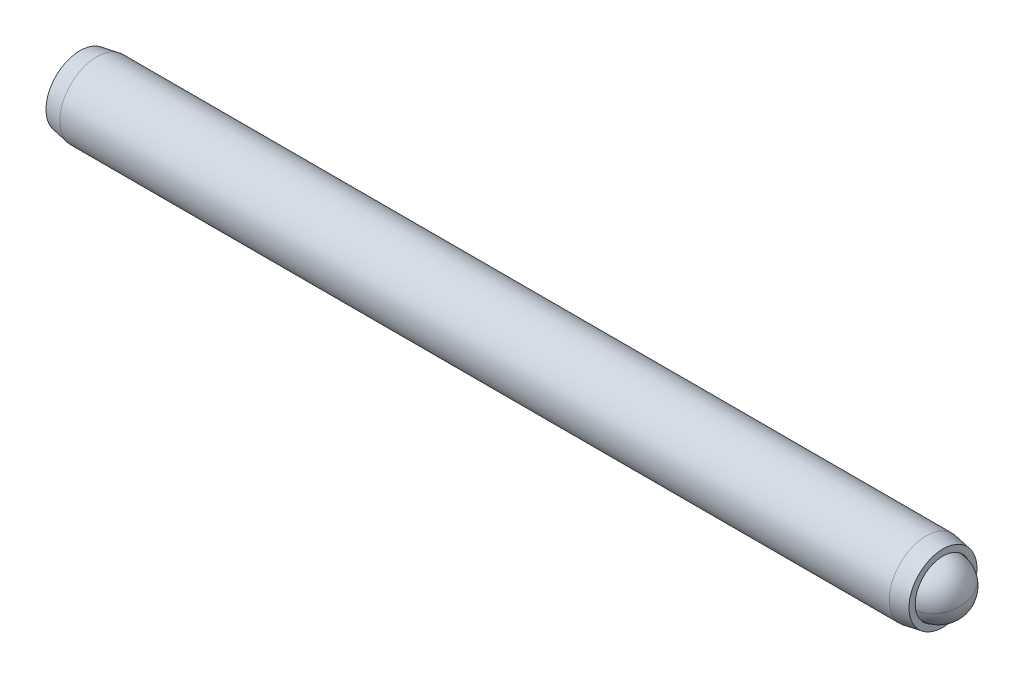
ISO-10303-21;
HEADER;
FILE_DESCRIPTION(('STEP AP214'),'2;1');
FILE_NAME('part.step','',(''),(''),'','','');
FILE_SCHEMA(('AUTOMOTIVE_DESIGN { 1 0 10303 214 1 1 1 1 }'));
ENDSEC;
DATA;
#1=APPLICATION_CONTEXT('core data for automotive mechanical design processes');
#2=APPLICATION_PROTOCOL_DEFINITION('international standard','automotive_design',2000,#1);
#3=PRODUCT_CONTEXT('',#1,'mechanical');
#4=PRODUCT('Part','Part','',(#3));
#5=PRODUCT_RELATED_PRODUCT_CATEGORY('part','',(#4));
#6=PRODUCT_DEFINITION_FORMATION('','',#4);
#7=PRODUCT_DEFINITION_CONTEXT('part definition',#1,'design');
#8=PRODUCT_DEFINITION('design','',#6,#7);
#9=PRODUCT_DEFINITION_SHAPE('','',#8);
#10=(LENGTH_UNIT() NAMED_UNIT(*) SI_UNIT(.MILLI.,.METRE.));
#11=(NAMED_UNIT(*) PLANE_ANGLE_UNIT() SI_UNIT($,.RADIAN.));
#12=(NAMED_UNIT(*) SI_UNIT($,.STERADIAN.) SOLID_ANGLE_UNIT());
#13=UNCERTAINTY_MEASURE_WITH_UNIT(LENGTH_MEASURE(1.E-05),#10,'distance_accuracy_value','');
#14=(GEOMETRIC_REPRESENTATION_CONTEXT(3) GLOBAL_UNCERTAINTY_ASSIGNED_CONTEXT((#13)) GLOBAL_UNIT_ASSIGNED_CONTEXT((#10,
#11,#12)) REPRESENTATION_CONTEXT('',''));
#15=CARTESIAN_POINT('',(0.,0.,0.));
#16=DIRECTION('',(0.,0.,1.));
#17=DIRECTION('',(1.,0.,0.));
#18=AXIS2_PLACEMENT_3D('',#15,#16,#17);
#19=CARTESIAN_POINT('',(-39.8013459470191,2.74204998828508,-0.965131231055238));
#20=DIRECTION('',(-1.,0.,0.));
#21=DIRECTION('',(0.,-1.,0.));
#22=AXIS2_PLACEMENT_3D('',#19,#20,#21);
#23=PLANE('',#22);
#24=DIRECTION('',(0.,0.866025403784439,-0.5));
#25=VECTOR('',#24,1.);
#26=CARTESIAN_POINT('',(-39.8013459470191,2.61504998828507,-2.33078112403966));
#27=LINE('',#26,#25);
#28=CARTESIAN_POINT('',(-39.8013459470191,1.49586248828507,-1.68461791964099));
#29=VERTEX_POINT('',#28);
#30=CARTESIAN_POINT('',(-39.8013459470191,2.74204998828508,-2.40410460822675));
#31=VERTEX_POINT('',#30);
#32=EDGE_CURVE('P0_E164',#29,#31,#27,.T.);
#33=ORIENTED_EDGE('',*,*,#32,.T.);
#34=DIRECTION('',(0.,0.866025403784439,0.5));
#35=VECTOR('',#34,1.);
#36=CARTESIAN_POINT('',(-39.8013459470191,3.86123748828508,-1.75794140382808));
#37=LINE('',#36,#35);
#38=CARTESIAN_POINT('',(-39.8013459470191,3.98823748828509,-1.68461791964099));
#39=VERTEX_POINT('',#38);
#40=EDGE_CURVE('P0_E166',#31,#39,#37,.T.);
#41=ORIENTED_EDGE('',*,*,#40,.T.);
#42=DIRECTION('',(0.,0.,1.));
#43=VECTOR('',#42,1.);
#44=CARTESIAN_POINT('',(-39.8013459470191,3.98823748828509,-0.392291510843657));
#45=LINE('',#44,#43);
#46=CARTESIAN_POINT('',(-39.8013459470191,3.98823748828509,-0.245644542469486));
#47=VERTEX_POINT('',#46);
#48=EDGE_CURVE('P0_E156',#39,#47,#45,.T.);
#49=ORIENTED_EDGE('',*,*,#48,.T.);
#50=DIRECTION('',(0.,-0.866025403784438,0.5));
#51=VECTOR('',#50,1.);
#52=CARTESIAN_POINT('',(-39.8013459470191,2.86904998828509,0.400518661929182));
#53=LINE('',#52,#51);
#54=CARTESIAN_POINT('',(-39.8013459470191,2.74204998828508,0.473842146116268));
#55=VERTEX_POINT('',#54);
#56=EDGE_CURVE('P0_E158',#47,#55,#53,.T.);
#57=ORIENTED_EDGE('',*,*,#56,.T.);
#58=DIRECTION('',(0.,-0.866025403784439,-0.499999999999999));
#59=VECTOR('',#58,1.);
#60=CARTESIAN_POINT('',(-39.8013459470191,1.62286248828507,-0.172321058282399));
#61=LINE('',#60,#59);
#62=CARTESIAN_POINT('',(-39.8013459470191,1.49586248828507,-0.245644542469485));
#63=VERTEX_POINT('',#62);
#64=EDGE_CURVE('P0_E160',#55,#63,#61,.T.);
#65=ORIENTED_EDGE('',*,*,#64,.T.);
#66=DIRECTION('',(0.,0.,-1.));
#67=VECTOR('',#66,1.);
#68=CARTESIAN_POINT('',(-39.8013459470191,1.49586248828507,-1.53797095126682));
#69=LINE('',#68,#67);
#70=EDGE_CURVE('P0_E162',#63,#29,#69,.T.);
#71=ORIENTED_EDGE('',*,*,#70,.T.);
#72=EDGE_LOOP('',(#33,#41,#49,#57,#65,#71));
#73=FACE_BOUND('',#72,.T.);
#74=CARTESIAN_POINT('',(-39.8013459470191,2.74204998828508,-0.965131231055238));
#75=DIRECTION('',(1.,0.,0.));
#76=DIRECTION('',(0.,1.,0.));
#77=AXIS2_PLACEMENT_3D('',#74,#75,#76);
#78=CIRCLE('',#77,2.921);
#79=CARTESIAN_POINT('',(-39.8013459470191,5.66304998828509,-0.965131231055238));
#80=VERTEX_POINT('',#79);
#81=EDGE_CURVE('P0_E150',#80,#80,#78,.T.);
#82=ORIENTED_EDGE('',*,*,#81,.F.);
#83=EDGE_LOOP('',(#82));
#84=FACE_BOUND('',#83,.T.);
#85=ADVANCED_FACE('P0_F17',(#73,#84),#23,.T.);
#86=CARTESIAN_POINT('',(-38.3608403648362,2.74204998828508,-0.965131231055238));
#87=DIRECTION('',(1.,0.,0.));
#88=DIRECTION('',(0.,1.,0.));
#89=AXIS2_PLACEMENT_3D('',#86,#87,#88);
#90=CONICAL_SURFACE('',#89,3.175,0.174532925199435);
#91=ORIENTED_EDGE('',*,*,#81,.T.);
#92=EDGE_LOOP('',(#91));
#93=FACE_BOUND('',#92,.T.);
#94=CARTESIAN_POINT('',(-38.3608403648362,2.74204998828508,-0.965131231055238));
#95=DIRECTION('',(1.,0.,0.));
#96=DIRECTION('',(0.,1.,0.));
#97=AXIS2_PLACEMENT_3D('',#94,#95,#96);
#98=CIRCLE('',#97,3.175);
#99=CARTESIAN_POINT('',(-38.3608403648362,5.91704998828509,-0.965131231055238));
#100=VERTEX_POINT('',#99);
#101=EDGE_CURVE('P0_E147',#100,#100,#98,.T.);
#102=ORIENTED_EDGE('',*,*,#101,.F.);
#103=EDGE_LOOP('',(#102));
#104=FACE_BOUND('',#103,.T.);
#105=ADVANCED_FACE('P0_F225',(#93,#104),#90,.T.);
#106=CARTESIAN_POINT('',(30.64980800758,2.7420499882851,-0.965131231055238));
#107=DIRECTION('',(1.,0.,0.));
#108=DIRECTION('',(0.,1.,0.));
#109=AXIS2_PLACEMENT_3D('',#106,#107,#108);
#110=CYLINDRICAL_SURFACE('',#109,3.175);
#111=ORIENTED_EDGE('',*,*,#101,.T.);
#112=EDGE_LOOP('',(#111));
#113=FACE_BOUND('',#112,.T.);
#114=CARTESIAN_POINT('',(32.926148470798,2.7420499882851,-0.965131231055238));
#115=DIRECTION('',(1.,0.,0.));
#116=DIRECTION('',(0.,1.,0.));
#117=AXIS2_PLACEMENT_3D('',#114,#115,#116);
#118=CIRCLE('',#117,3.17499999999999);
#119=CARTESIAN_POINT('',(32.926148470798,5.91704998828509,-0.965131231055238));
#120=VERTEX_POINT('',#119);
#121=EDGE_CURVE('P0_E144',#120,#120,#118,.T.);
#122=ORIENTED_EDGE('',*,*,#121,.F.);
#123=EDGE_LOOP('',(#122));
#124=FACE_BOUND('',#123,.T.);
#125=ADVANCED_FACE('P0_F231',(#113,#124),#110,.T.);
#126=CARTESIAN_POINT('',(34.3666540529809,2.7420499882851,-0.965131231055238));
#127=DIRECTION('',(-1.,0.,0.));
#128=DIRECTION('',(0.,-1.,0.));
#129=AXIS2_PLACEMENT_3D('',#126,#127,#128);
#130=CONICAL_SURFACE('',#129,2.92099999999999,0.174532925199435);
#131=ORIENTED_EDGE('',*,*,#121,.T.);
#132=EDGE_LOOP('',(#131));
#133=FACE_BOUND('',#132,.T.);
#134=CARTESIAN_POINT('',(34.3666540529809,2.7420499882851,-0.965131231055238));
#135=DIRECTION('',(1.,0.,0.));
#136=DIRECTION('',(0.,1.,0.));
#137=AXIS2_PLACEMENT_3D('',#134,#135,#136);
#138=CIRCLE('',#137,2.92099999999999);
#139=CARTESIAN_POINT('',(34.3666540529809,5.66304998828509,-0.965131231055238));
#140=VERTEX_POINT('',#139);
#141=EDGE_CURVE('P0_E141',#140,#140,#138,.T.);
#142=ORIENTED_EDGE('',*,*,#141,.F.);
#143=EDGE_LOOP('',(#142));
#144=FACE_BOUND('',#143,.T.);
#145=ADVANCED_FACE('P0_F275',(#133,#144),#130,.T.);
#146=CARTESIAN_POINT('',(34.3666540529809,5.66304998828509,-0.965131231055238));
#147=DIRECTION('',(1.,0.,0.));
#148=DIRECTION('',(0.,1.,0.));
#149=AXIS2_PLACEMENT_3D('',#146,#147,#148);
#150=PLANE('',#149);
#151=ORIENTED_EDGE('',*,*,#141,.T.);
#152=EDGE_LOOP('',(#151));
#153=FACE_BOUND('',#152,.T.);
#154=CARTESIAN_POINT('',(34.3666540529809,2.7420499882851,-0.965131231055238));
#155=DIRECTION('',(1.,0.,0.));
#156=DIRECTION('',(0.,1.,0.));
#157=AXIS2_PLACEMENT_3D('',#154,#155,#156);
#158=CIRCLE('',#157,2.3876);
#159=CARTESIAN_POINT('',(34.3666540529809,5.1296499882851,-0.965131231055238));
#160=VERTEX_POINT('',#159);
#161=EDGE_CURVE('P0_E138',#160,#160,#158,.T.);
#162=ORIENTED_EDGE('',*,*,#161,.F.);
#163=EDGE_LOOP('',(#162));
#164=FACE_BOUND('',#163,.T.);
#165=ADVANCED_FACE('P0_F271',(#153,#164),#150,.T.);
#166=CARTESIAN_POINT('',(30.64980800758,2.7420499882851,-0.965131231055238));
#167=DIRECTION('',(1.,0.,0.));
#168=DIRECTION('',(0.,1.,0.));
#169=AXIS2_PLACEMENT_3D('',#166,#167,#168);
#170=CYLINDRICAL_SURFACE('',#169,2.3876);
#171=ORIENTED_EDGE('',*,*,#161,.T.);
#172=EDGE_LOOP('',(#171));
#173=FACE_BOUND('',#172,.T.);
#174=CARTESIAN_POINT('',(33.0374080075799,2.7420499882851,-0.965131231055238));
#175=DIRECTION('',(1.,0.,0.));
#176=DIRECTION('',(0.,1.,0.));
#177=AXIS2_PLACEMENT_3D('',#174,#175,#176);
#178=CIRCLE('',#177,2.3876);
#179=CARTESIAN_POINT('',(33.0374080075799,5.1296499882851,-0.965131231055238));
#180=VERTEX_POINT('',#179);
#181=EDGE_CURVE('P0_E126',#180,#180,#178,.T.);
#182=ORIENTED_EDGE('',*,*,#181,.F.);
#183=EDGE_LOOP('',(#182));
#184=FACE_BOUND('',#183,.T.);
#185=ADVANCED_FACE('P0_F267',(#173,#184),#170,.F.);
#186=CARTESIAN_POINT('',(30.64980800758,2.7420499882851,-0.965131231055238));
#187=DIRECTION('',(1.,0.,0.));
#188=DIRECTION('',(0.,1.,0.));
#189=AXIS2_PLACEMENT_3D('',#186,#187,#188);
#190=CONICAL_SURFACE('',#189,0.,0.785398163397451);
#191=ORIENTED_EDGE('',*,*,#181,.T.);
#192=EDGE_LOOP('',(#191));
#193=FACE_BOUND('',#192,.T.);
#194=CARTESIAN_POINT('',(30.64980800758,2.7420499882851,-0.965131231055238));
#195=VERTEX_POINT('',#194);
#196=VERTEX_LOOP('',#195);
#197=FACE_BOUND('',#196,.T.);
#198=ADVANCED_FACE('P0_F221',(#193,#197),#190,.F.);
#199=CARTESIAN_POINT('',(-36.7533459470191,2.74204998828508,0.180548209367925));
#200=DIRECTION('',(0.,0.5,0.866025403784438));
#201=DIRECTION('',(0.,-0.866025403784438,0.5));
#202=AXIS2_PLACEMENT_3D('',#199,#200,#201);
#203=PLANE('',#202);
#204=DIRECTION('',(-1.,0.,0.));
#205=VECTOR('',#204,1.);
#206=CARTESIAN_POINT('',(-36.7533459470191,2.74204998828508,0.180548209367925));
#207=LINE('',#206,#205);
#208=CARTESIAN_POINT('',(-36.7533459470191,2.74204998828508,0.180548209367925));
#209=VERTEX_POINT('',#208);
#210=CARTESIAN_POINT('',(-39.5473459470191,2.74204998828508,0.180548209367925));
#211=VERTEX_POINT('',#210);
#212=EDGE_CURVE('P0_E124',#209,#211,#207,.T.);
#213=ORIENTED_EDGE('',*,*,#212,.T.);
#214=DIRECTION('',(0.,0.866025403784438,-0.5));
#215=VECTOR('',#214,1.);
#216=CARTESIAN_POINT('',(-39.5473459470191,3.73423748828508,-0.392291510843657));
#217=LINE('',#216,#215);
#218=CARTESIAN_POINT('',(-39.5473459470191,3.73423748828508,-0.392291510843657));
#219=VERTEX_POINT('',#218);
#220=EDGE_CURVE('P0_E26',#211,#219,#217,.T.);
#221=ORIENTED_EDGE('',*,*,#220,.T.);
#222=DIRECTION('',(-1.,0.,0.));
#223=VECTOR('',#222,1.);
#224=CARTESIAN_POINT('',(-36.7533459470191,3.73423748828508,-0.392291510843657));
#225=LINE('',#224,#223);
#226=CARTESIAN_POINT('',(-36.7533459470191,3.73423748828508,-0.392291510843657));
#227=VERTEX_POINT('',#226);
#228=EDGE_CURVE('P0_E90',#227,#219,#225,.T.);
#229=ORIENTED_EDGE('',*,*,#228,.F.);
#230=DIRECTION('',(0.,0.866025403784438,-0.5));
#231=VECTOR('',#230,1.);
#232=CARTESIAN_POINT('',(-36.7533459470191,2.74204998828508,0.180548209367925));
#233=LINE('',#232,#231);
#234=EDGE_CURVE('P0_E94',#209,#227,#233,.T.);
#235=ORIENTED_EDGE('',*,*,#234,.F.);
#236=EDGE_LOOP('',(#213,#221,#229,#235));
#237=FACE_BOUND('',#236,.T.);
#238=ADVANCED_FACE('P0_F92',(#237),#203,.F.);
#239=CARTESIAN_POINT('',(-36.7533459470191,1.74986248828508,-0.392291510843657));
#240=DIRECTION('',(0.,-0.499999999999999,0.866025403784439));
#241=DIRECTION('',(0.,-0.866025403784439,-0.499999999999999));
#242=AXIS2_PLACEMENT_3D('',#239,#240,#241);
#243=PLANE('',#242);
#244=DIRECTION('',(-1.,0.,0.));
#245=VECTOR('',#244,1.);
#246=CARTESIAN_POINT('',(-36.7533459470191,1.74986248828508,-0.392291510843657));
#247=LINE('',#246,#245);
#248=CARTESIAN_POINT('',(-36.7533459470191,1.74986248828508,-0.392291510843657));
#249=VERTEX_POINT('',#248);
#250=CARTESIAN_POINT('',(-39.5473459470191,1.74986248828508,-0.392291510843657));
#251=VERTEX_POINT('',#250);
#252=EDGE_CURVE('P0_E127',#249,#251,#247,.T.);
#253=ORIENTED_EDGE('',*,*,#252,.T.);
#254=DIRECTION('',(0.,0.866025403784439,0.499999999999999));
#255=VECTOR('',#254,1.);
#256=CARTESIAN_POINT('',(-39.5473459470191,2.74204998828508,0.180548209367925));
#257=LINE('',#256,#255);
#258=EDGE_CURVE('P0_E41',#251,#211,#257,.T.);
#259=ORIENTED_EDGE('',*,*,#258,.T.);
#260=ORIENTED_EDGE('',*,*,#212,.F.);
#261=DIRECTION('',(0.,0.866025403784439,0.499999999999999));
#262=VECTOR('',#261,1.);
#263=CARTESIAN_POINT('',(-36.7533459470191,1.74986248828508,-0.392291510843657));
#264=LINE('',#263,#262);
#265=EDGE_CURVE('P0_E99',#249,#209,#264,.T.);
#266=ORIENTED_EDGE('',*,*,#265,.F.);
#267=EDGE_LOOP('',(#253,#259,#260,#266));
#268=FACE_BOUND('',#267,.T.);
#269=ADVANCED_FACE('P0_F212',(#268),#243,.F.);
#270=CARTESIAN_POINT('',(-36.7533459470191,1.74986248828508,-1.53797095126682));
#271=DIRECTION('',(0.,-1.,0.));
#272=DIRECTION('',(0.,0.,-1.));
#273=AXIS2_PLACEMENT_3D('',#270,#271,#272);
#274=PLANE('',#273);
#275=DIRECTION('',(-1.,0.,0.));
#276=VECTOR('',#275,1.);
#277=CARTESIAN_POINT('',(-36.7533459470191,1.74986248828508,-1.53797095126682));
#278=LINE('',#277,#276);
#279=CARTESIAN_POINT('',(-36.7533459470191,1.74986248828508,-1.53797095126682));
#280=VERTEX_POINT('',#279);
#281=CARTESIAN_POINT('',(-39.5473459470191,1.74986248828508,-1.53797095126682));
#282=VERTEX_POINT('',#281);
#283=EDGE_CURVE('P0_E129',#280,#282,#278,.T.);
#284=ORIENTED_EDGE('',*,*,#283,.T.);
#285=DIRECTION('',(0.,0.,1.));
#286=VECTOR('',#285,1.);
#287=CARTESIAN_POINT('',(-39.5473459470191,1.74986248828508,-0.392291510843657));
#288=LINE('',#287,#286);
#289=EDGE_CURVE('P0_E171',#282,#251,#288,.T.);
#290=ORIENTED_EDGE('',*,*,#289,.T.);
#291=ORIENTED_EDGE('',*,*,#252,.F.);
#292=DIRECTION('',(0.,0.,1.));
#293=VECTOR('',#292,1.);
#294=CARTESIAN_POINT('',(-36.7533459470191,1.74986248828508,-1.53797095126682));
#295=LINE('',#294,#293);
#296=EDGE_CURVE('P0_E121',#280,#249,#295,.T.);
#297=ORIENTED_EDGE('',*,*,#296,.F.);
#298=EDGE_LOOP('',(#284,#290,#291,#297));
#299=FACE_BOUND('',#298,.T.);
#300=ADVANCED_FACE('P0_F211',(#299),#274,.F.);
#301=CARTESIAN_POINT('',(-36.7533459470191,2.74204998828508,-2.1108106714784));
#302=DIRECTION('',(0.,-0.5,-0.866025403784438));
#303=DIRECTION('',(0.,0.866025403784439,-0.5));
#304=AXIS2_PLACEMENT_3D('',#301,#302,#303);
#305=PLANE('',#304);
#306=DIRECTION('',(-1.,0.,0.));
#307=VECTOR('',#306,1.);
#308=CARTESIAN_POINT('',(-36.7533459470191,2.74204998828508,-2.1108106714784));
#309=LINE('',#308,#307);
#310=CARTESIAN_POINT('',(-36.7533459470191,2.74204998828508,-2.1108106714784));
#311=VERTEX_POINT('',#310);
#312=CARTESIAN_POINT('',(-39.5473459470191,2.74204998828508,-2.1108106714784));
#313=VERTEX_POINT('',#312);
#314=EDGE_CURVE('P0_E132',#311,#313,#309,.T.);
#315=ORIENTED_EDGE('',*,*,#314,.T.);
#316=DIRECTION('',(0.,-0.866025403784439,0.5));
#317=VECTOR('',#316,1.);
#318=CARTESIAN_POINT('',(-39.5473459470191,1.74986248828508,-1.53797095126682));
#319=LINE('',#318,#317);
#320=EDGE_CURVE('P0_E169',#313,#282,#319,.T.);
#321=ORIENTED_EDGE('',*,*,#320,.T.);
#322=ORIENTED_EDGE('',*,*,#283,.F.);
#323=DIRECTION('',(0.,-0.866025403784438,0.5));
#324=VECTOR('',#323,1.);
#325=CARTESIAN_POINT('',(-36.7533459470191,2.74204998828508,-2.1108106714784));
#326=LINE('',#325,#324);
#327=EDGE_CURVE('P0_E118',#311,#280,#326,.T.);
#328=ORIENTED_EDGE('',*,*,#327,.F.);
#329=EDGE_LOOP('',(#315,#321,#322,#328));
#330=FACE_BOUND('',#329,.T.);
#331=ADVANCED_FACE('P0_F208',(#330),#305,.F.);
#332=CARTESIAN_POINT('',(-36.7533459470191,3.73423748828508,-1.53797095126682));
#333=DIRECTION('',(0.,0.5,-0.866025403784439));
#334=DIRECTION('',(0.,0.866025403784439,0.5));
#335=AXIS2_PLACEMENT_3D('',#332,#333,#334);
#336=PLANE('',#335);
#337=DIRECTION('',(-1.,0.,0.));
#338=VECTOR('',#337,1.);
#339=CARTESIAN_POINT('',(-36.7533459470191,3.73423748828508,-1.53797095126682));
#340=LINE('',#339,#338);
#341=CARTESIAN_POINT('',(-36.7533459470191,3.73423748828508,-1.53797095126682));
#342=VERTEX_POINT('',#341);
#343=CARTESIAN_POINT('',(-39.5473459470191,3.73423748828508,-1.53797095126682));
#344=VERTEX_POINT('',#343);
#345=EDGE_CURVE('P0_E98',#342,#344,#340,.T.);
#346=ORIENTED_EDGE('',*,*,#345,.T.);
#347=DIRECTION('',(0.,-0.866025403784439,-0.5));
#348=VECTOR('',#347,1.);
#349=CARTESIAN_POINT('',(-39.5473459470191,2.74204998828508,-2.1108106714784));
#350=LINE('',#349,#348);
#351=EDGE_CURVE('P0_E153',#344,#313,#350,.T.);
#352=ORIENTED_EDGE('',*,*,#351,.T.);
#353=ORIENTED_EDGE('',*,*,#314,.F.);
#354=DIRECTION('',(0.,-0.866025403784439,-0.5));
#355=VECTOR('',#354,1.);
#356=CARTESIAN_POINT('',(-36.7533459470191,3.73423748828508,-1.53797095126682));
#357=LINE('',#356,#355);
#358=EDGE_CURVE('P0_E108',#342,#311,#357,.T.);
#359=ORIENTED_EDGE('',*,*,#358,.F.);
#360=EDGE_LOOP('',(#346,#352,#353,#359));
#361=FACE_BOUND('',#360,.T.);
#362=ADVANCED_FACE('P0_F204',(#361),#336,.F.);
#363=CARTESIAN_POINT('',(-36.7533459470191,3.73423748828508,-0.392291510843657));
#364=DIRECTION('',(0.,1.,0.));
#365=DIRECTION('',(0.,0.,1.));
#366=AXIS2_PLACEMENT_3D('',#363,#364,#365);
#367=PLANE('',#366);
#368=ORIENTED_EDGE('',*,*,#228,.T.);
#369=DIRECTION('',(0.,0.,-1.));
#370=VECTOR('',#369,1.);
#371=CARTESIAN_POINT('',(-39.5473459470191,3.73423748828508,-1.53797095126682));
#372=LINE('',#371,#370);
#373=EDGE_CURVE('P0_E11',#219,#344,#372,.T.);
#374=ORIENTED_EDGE('',*,*,#373,.T.);
#375=ORIENTED_EDGE('',*,*,#345,.F.);
#376=DIRECTION('',(0.,0.,-1.));
#377=VECTOR('',#376,1.);
#378=CARTESIAN_POINT('',(-36.7533459470191,3.73423748828508,-0.392291510843657));
#379=LINE('',#378,#377);
#380=EDGE_CURVE('P0_E102',#227,#342,#379,.T.);
#381=ORIENTED_EDGE('',*,*,#380,.F.);
#382=EDGE_LOOP('',(#368,#374,#375,#381));
#383=FACE_BOUND('',#382,.T.);
#384=ADVANCED_FACE('P0_F103',(#383),#367,.F.);
#385=CARTESIAN_POINT('',(-36.7533459470191,4.72642498828508,-0.965131231055239));
#386=DIRECTION('',(-1.,0.,0.));
#387=DIRECTION('',(0.,0.,1.));
#388=AXIS2_PLACEMENT_3D('',#385,#386,#387);
#389=PLANE('',#388);
#390=ORIENTED_EDGE('',*,*,#234,.T.);
#391=ORIENTED_EDGE('',*,*,#380,.T.);
#392=ORIENTED_EDGE('',*,*,#358,.T.);
#393=ORIENTED_EDGE('',*,*,#327,.T.);
#394=ORIENTED_EDGE('',*,*,#296,.T.);
#395=ORIENTED_EDGE('',*,*,#265,.T.);
#396=EDGE_LOOP('',(#390,#391,#392,#393,#394,#395));
#397=FACE_BOUND('',#396,.T.);
#398=ADVANCED_FACE('P0_F110',(#397),#389,.T.);
#399=CARTESIAN_POINT('',(-39.5473459470191,1.74986248828508,-0.392291510843657));
#400=DIRECTION('',(-0.707106781186548,0.353553390593273,-0.612372435695795));
#401=DIRECTION('',(-0.654653670707977,0.,0.755928946018455));
#402=AXIS2_PLACEMENT_3D('',#399,#400,#401);
#403=PLANE('',#402);
#404=DIRECTION('',(-0.654653670707977,-0.654653670707977,0.377964473009228));
#405=VECTOR('',#404,1.);
#406=CARTESIAN_POINT('',(-39.263863804162,2.03334463114222,-0.55596000233268));
#407=LINE('',#406,#405);
#408=EDGE_CURVE('P0_E115',#63,#251,#407,.F.);
#409=ORIENTED_EDGE('',*,*,#408,.F.);
#410=ORIENTED_EDGE('',*,*,#64,.F.);
#411=DIRECTION('',(-0.654653670707977,0.,0.755928946018454));
#412=VECTOR('',#411,1.);
#413=CARTESIAN_POINT('',(-39.263863804162,2.74204998828508,-0.146788773610121));
#414=LINE('',#413,#412);
#415=EDGE_CURVE('P0_E21',#211,#55,#414,.T.);
#416=ORIENTED_EDGE('',*,*,#415,.F.);
#417=ORIENTED_EDGE('',*,*,#258,.F.);
#418=EDGE_LOOP('',(#409,#410,#416,#417));
#419=FACE_BOUND('',#418,.T.);
#420=ADVANCED_FACE('P0_F19',(#419),#403,.T.);
#421=CARTESIAN_POINT('',(-39.5473459470191,2.74204998828508,0.180548209367925));
#422=DIRECTION('',(-0.707106781186547,-0.353553390593274,-0.612372435695794));
#423=DIRECTION('',(-0.654653670707977,0.,0.755928946018454));
#424=AXIS2_PLACEMENT_3D('',#421,#422,#423);
#425=PLANE('',#424);
#426=ORIENTED_EDGE('',*,*,#415,.T.);
#427=ORIENTED_EDGE('',*,*,#56,.F.);
#428=DIRECTION('',(-0.654653670707977,0.654653670707977,0.377964473009227));
#429=VECTOR('',#428,1.);
#430=CARTESIAN_POINT('',(-39.263863804162,3.45075534542794,-0.55596000233268));
#431=LINE('',#430,#429);
#432=EDGE_CURVE('P0_E182',#219,#47,#431,.T.);
#433=ORIENTED_EDGE('',*,*,#432,.F.);
#434=ORIENTED_EDGE('',*,*,#220,.F.);
#435=EDGE_LOOP('',(#426,#427,#433,#434));
#436=FACE_BOUND('',#435,.T.);
#437=ADVANCED_FACE('P0_F196',(#436),#425,.T.);
#438=CARTESIAN_POINT('',(-39.5473459470191,1.74986248828508,-1.53797095126682));
#439=DIRECTION('',(-0.707106781186548,0.707106781186547,0.));
#440=DIRECTION('',(-0.707106781186547,-0.707106781186548,0.));
#441=AXIS2_PLACEMENT_3D('',#438,#439,#440);
#442=PLANE('',#441);
#443=ORIENTED_EDGE('',*,*,#408,.T.);
#444=ORIENTED_EDGE('',*,*,#289,.F.);
#445=DIRECTION('',(-0.654653670707977,-0.654653670707977,-0.377964473009227));
#446=VECTOR('',#445,1.);
#447=CARTESIAN_POINT('',(-39.263863804162,2.03334463114222,-1.3743024597778));
#448=LINE('',#447,#446);
#449=EDGE_CURVE('P0_E179',#29,#282,#448,.F.);
#450=ORIENTED_EDGE('',*,*,#449,.F.);
#451=ORIENTED_EDGE('',*,*,#70,.F.);
#452=EDGE_LOOP('',(#443,#444,#450,#451));
#453=FACE_BOUND('',#452,.T.);
#454=ADVANCED_FACE('P0_F189',(#453),#442,.T.);
#455=CARTESIAN_POINT('',(-39.5473459470191,3.73423748828508,-0.392291510843657));
#456=DIRECTION('',(-0.707106781186547,-0.707106781186548,0.));
#457=DIRECTION('',(0.707106781186548,-0.707106781186547,0.));
#458=AXIS2_PLACEMENT_3D('',#455,#456,#457);
#459=PLANE('',#458);
#460=ORIENTED_EDGE('',*,*,#432,.T.);
#461=ORIENTED_EDGE('',*,*,#48,.F.);
#462=DIRECTION('',(0.654653670707977,-0.654653670707977,0.377964473009228));
#463=VECTOR('',#462,1.);
#464=CARTESIAN_POINT('',(-39.5473459470191,3.73423748828508,-1.53797095126682));
#465=LINE('',#464,#463);
#466=EDGE_CURVE('P0_E177',#344,#39,#465,.F.);
#467=ORIENTED_EDGE('',*,*,#466,.F.);
#468=ORIENTED_EDGE('',*,*,#373,.F.);
#469=EDGE_LOOP('',(#460,#461,#467,#468));
#470=FACE_BOUND('',#469,.T.);
#471=ADVANCED_FACE('P0_F201',(#470),#459,.T.);
#472=CARTESIAN_POINT('',(-39.5473459470191,2.74204998828508,-2.1108106714784));
#473=DIRECTION('',(-0.707106781186547,0.353553390593274,0.612372435695795));
#474=DIRECTION('',(0.654653670707977,0.,0.755928946018454));
#475=AXIS2_PLACEMENT_3D('',#472,#473,#474);
#476=PLANE('',#475);
#477=ORIENTED_EDGE('',*,*,#449,.T.);
#478=ORIENTED_EDGE('',*,*,#320,.F.);
#479=DIRECTION('',(-0.654653670707977,0.,-0.755928946018455));
#480=VECTOR('',#479,1.);
#481=CARTESIAN_POINT('',(-39.263863804162,2.74204998828508,-1.78347368850036));
#482=LINE('',#481,#480);
#483=EDGE_CURVE('P0_E175',#31,#313,#482,.F.);
#484=ORIENTED_EDGE('',*,*,#483,.F.);
#485=ORIENTED_EDGE('',*,*,#32,.F.);
#486=EDGE_LOOP('',(#477,#478,#484,#485));
#487=FACE_BOUND('',#486,.T.);
#488=ADVANCED_FACE('P0_F240',(#487),#476,.T.);
#489=CARTESIAN_POINT('',(-39.5473459470191,3.73423748828508,-1.53797095126682));
#490=DIRECTION('',(-0.707106781186548,-0.353553390593274,0.612372435695794));
#491=DIRECTION('',(0.654653670707977,0.,0.755928946018455));
#492=AXIS2_PLACEMENT_3D('',#489,#490,#491);
#493=PLANE('',#492);
#494=ORIENTED_EDGE('',*,*,#466,.T.);
#495=ORIENTED_EDGE('',*,*,#40,.F.);
#496=ORIENTED_EDGE('',*,*,#483,.T.);
#497=ORIENTED_EDGE('',*,*,#351,.F.);
#498=EDGE_LOOP('',(#494,#495,#496,#497));
#499=FACE_BOUND('',#498,.T.);
#500=ADVANCED_FACE('P0_F237',(#499),#493,.T.);
#501=CLOSED_SHELL('',(#85,#105,#125,#145,#165,#185,#198,#238,#269,#300,#331,#362,#384,#398,#420,
#437,#454,#471,#488,#500));
#502=MANIFOLD_SOLID_BREP('P0_B1',#501);
#503=CARTESIAN_POINT('',(34.0174040529809,2.74204998828509,-0.96513123105524));
#504=DIRECTION('',(0.,0.972214232741158,0.234092899626454));
#505=DIRECTION('',(0.,0.234092899626454,-0.972214232741158));
#506=AXIS2_PLACEMENT_3D('',#503,#504,#505);
#507=SPHERICAL_SURFACE('',#506,2.38125);
#508=CARTESIAN_POINT('',(34.0174040529809,2.74204998828509,-0.96513123105524));
#509=DIRECTION('',(1.,0.,0.));
#510=DIRECTION('',(0.,0.234092899626454,-0.972214232741158));
#511=AXIS2_PLACEMENT_3D('',#508,#509,#510);
#512=CIRCLE('',#511,2.38125);
#513=CARTESIAN_POINT('',(34.0174040529809,3.29948370552059,-3.28021637277012));
#514=VERTEX_POINT('',#513);
#515=CARTESIAN_POINT('',(34.0174040529809,2.1846162710496,1.34995391065964));
#516=VERTEX_POINT('',#515);
#517=EDGE_CURVE('P1_E33',#514,#516,#512,.T.);
#518=ORIENTED_EDGE('',*,*,#517,.T.);
#519=CARTESIAN_POINT('',(34.0174040529809,2.74204998828509,-0.96513123105524));
#520=DIRECTION('',(0.,0.972214232741158,0.234092899626454));
#521=DIRECTION('',(1.,0.,0.));
#522=AXIS2_PLACEMENT_3D('',#519,#520,#521);
#523=CIRCLE('',#522,2.38125);
#524=EDGE_CURVE('P1_E10',#516,#514,#523,.T.);
#525=ORIENTED_EDGE('',*,*,#524,.T.);
#526=EDGE_LOOP('',(#518,#525));
#527=FACE_BOUND('',#526,.T.);
#528=ADVANCED_FACE('P1_F16',(#527),#507,.T.);
#529=ORIENTED_EDGE('',*,*,#517,.F.);
#530=CARTESIAN_POINT('',(34.0174040529809,2.74204998828509,-0.96513123105524));
#531=DIRECTION('',(0.,0.972214232741158,0.234092899626454));
#532=DIRECTION('',(1.,0.,0.));
#533=AXIS2_PLACEMENT_3D('',#530,#531,#532);
#534=CIRCLE('',#533,2.38125);
#535=EDGE_CURVE('P1_E23',#514,#516,#534,.T.);
#536=ORIENTED_EDGE('',*,*,#535,.T.);
#537=EDGE_LOOP('',(#529,#536));
#538=FACE_BOUND('',#537,.T.);
#539=ADVANCED_FACE('P1_F40',(#538),#507,.T.);
#540=ORIENTED_EDGE('',*,*,#524,.F.);
#541=EDGE_CURVE('P1_E36',#516,#514,#512,.T.);
#542=ORIENTED_EDGE('',*,*,#541,.T.);
#543=EDGE_LOOP('',(#540,#542));
#544=FACE_BOUND('',#543,.T.);
#545=ADVANCED_FACE('P1_F38',(#544),#507,.T.);
#546=ORIENTED_EDGE('',*,*,#535,.F.);
#547=ORIENTED_EDGE('',*,*,#541,.F.);
#548=EDGE_LOOP('',(#546,#547));
#549=FACE_BOUND('',#548,.T.);
#550=ADVANCED_FACE('P1_F18',(#549),#507,.T.);
#551=CLOSED_SHELL('',(#528,#539,#545,#550));
#552=MANIFOLD_SOLID_BREP('P1_B1',#551);
#553=ADVANCED_BREP_SHAPE_REPRESENTATION('',(#18,#502,#552),#14);
#554=SHAPE_DEFINITION_REPRESENTATION(#9,#553);
ENDSEC;
END-ISO-10303-21;
